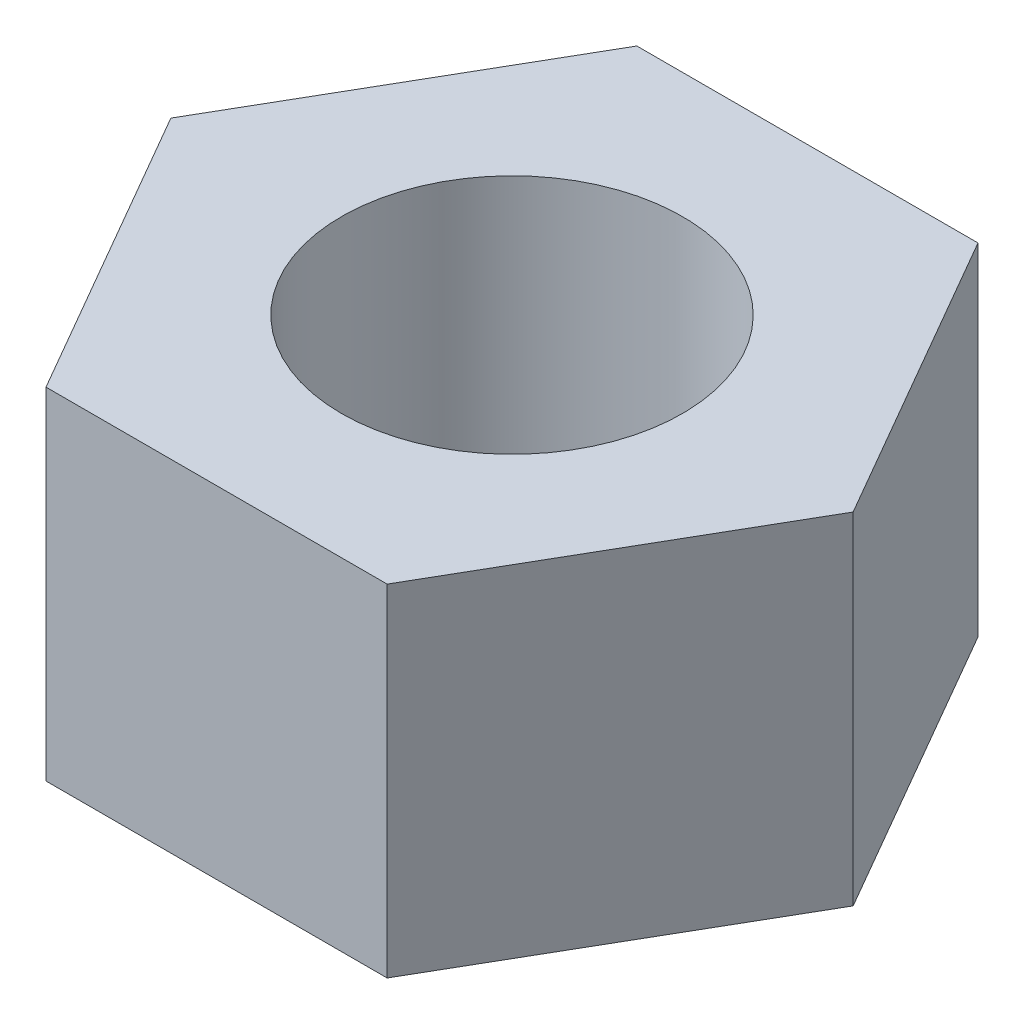
ISO-10303-21;
HEADER;
FILE_DESCRIPTION(('STEP AP214'),'2;1');
FILE_NAME('part.step','',(''),(''),'','','');
FILE_SCHEMA(('AUTOMOTIVE_DESIGN { 1 0 10303 214 1 1 1 1 }'));
ENDSEC;
DATA;
#1=APPLICATION_CONTEXT('core data for automotive mechanical design processes');
#2=APPLICATION_PROTOCOL_DEFINITION('international standard','automotive_design',2000,#1);
#3=PRODUCT_CONTEXT('',#1,'mechanical');
#4=PRODUCT('Part','Part','',(#3));
#5=PRODUCT_RELATED_PRODUCT_CATEGORY('part','',(#4));
#6=PRODUCT_DEFINITION_FORMATION('','',#4);
#7=PRODUCT_DEFINITION_CONTEXT('part definition',#1,'design');
#8=PRODUCT_DEFINITION('design','',#6,#7);
#9=PRODUCT_DEFINITION_SHAPE('','',#8);
#10=(LENGTH_UNIT() NAMED_UNIT(*) SI_UNIT(.MILLI.,.METRE.));
#11=(NAMED_UNIT(*) PLANE_ANGLE_UNIT() SI_UNIT($,.RADIAN.));
#12=(NAMED_UNIT(*) SI_UNIT($,.STERADIAN.) SOLID_ANGLE_UNIT());
#13=UNCERTAINTY_MEASURE_WITH_UNIT(LENGTH_MEASURE(1.E-05),#10,'distance_accuracy_value','');
#14=(GEOMETRIC_REPRESENTATION_CONTEXT(3) GLOBAL_UNCERTAINTY_ASSIGNED_CONTEXT((#13)) GLOBAL_UNIT_ASSIGNED_CONTEXT((#10,
#11,#12)) REPRESENTATION_CONTEXT('',''));
#15=CARTESIAN_POINT('',(0.,0.,0.));
#16=DIRECTION('',(0.,0.,1.));
#17=DIRECTION('',(1.,0.,0.));
#18=AXIS2_PLACEMENT_3D('',#15,#16,#17);
#19=CARTESIAN_POINT('',(0.,4.5,0.));
#20=DIRECTION('',(0.,1.,0.));
#21=DIRECTION('',(0.,0.,1.));
#22=AXIS2_PLACEMENT_3D('',#19,#20,#21);
#23=PLANE('',#22);
#24=DIRECTION('',(1.,0.,0.));
#25=VECTOR('',#24,1.);
#26=CARTESIAN_POINT('',(-4.5,4.5,7.79422863405995));
#27=LINE('',#26,#25);
#28=CARTESIAN_POINT('',(-4.5,4.5,7.79422863405995));
#29=VERTEX_POINT('',#28);
#30=CARTESIAN_POINT('',(4.5,4.5,7.79422863405995));
#31=VERTEX_POINT('',#30);
#32=EDGE_CURVE('E129',#29,#31,#27,.T.);
#33=ORIENTED_EDGE('',*,*,#32,.T.);
#34=DIRECTION('',(0.5,0.,-0.866025403784438));
#35=VECTOR('',#34,1.);
#36=CARTESIAN_POINT('',(4.5,4.5,7.79422863405995));
#37=LINE('',#36,#35);
#38=CARTESIAN_POINT('',(9.,4.5,0.));
#39=VERTEX_POINT('',#38);
#40=EDGE_CURVE('E87',#31,#39,#37,.T.);
#41=ORIENTED_EDGE('',*,*,#40,.T.);
#42=DIRECTION('',(-0.5,0.,-0.866025403784439));
#43=VECTOR('',#42,1.);
#44=CARTESIAN_POINT('',(9.,4.5,0.));
#45=LINE('',#44,#43);
#46=CARTESIAN_POINT('',(4.5,4.5,-7.79422863405995));
#47=VERTEX_POINT('',#46);
#48=EDGE_CURVE('E100',#39,#47,#45,.T.);
#49=ORIENTED_EDGE('',*,*,#48,.T.);
#50=DIRECTION('',(-1.,0.,0.));
#51=VECTOR('',#50,1.);
#52=CARTESIAN_POINT('',(4.5,4.5,-7.79422863405995));
#53=LINE('',#52,#51);
#54=CARTESIAN_POINT('',(-4.5,4.5,-7.79422863405995));
#55=VERTEX_POINT('',#54);
#56=EDGE_CURVE('E94',#47,#55,#53,.T.);
#57=ORIENTED_EDGE('',*,*,#56,.T.);
#58=DIRECTION('',(-0.5,0.,0.866025403784439));
#59=VECTOR('',#58,1.);
#60=CARTESIAN_POINT('',(-4.5,4.5,-7.79422863405995));
#61=LINE('',#60,#59);
#62=CARTESIAN_POINT('',(-9.,4.5,0.));
#63=VERTEX_POINT('',#62);
#64=EDGE_CURVE('E98',#55,#63,#61,.T.);
#65=ORIENTED_EDGE('',*,*,#64,.T.);
#66=DIRECTION('',(0.5,0.,0.866025403784439));
#67=VECTOR('',#66,1.);
#68=CARTESIAN_POINT('',(-9.,4.5,0.));
#69=LINE('',#68,#67);
#70=EDGE_CURVE('E50',#63,#29,#69,.T.);
#71=ORIENTED_EDGE('',*,*,#70,.T.);
#72=EDGE_LOOP('',(#33,#41,#49,#57,#65,#71));
#73=FACE_BOUND('',#72,.T.);
#74=CARTESIAN_POINT('',(0.,4.5,0.));
#75=DIRECTION('',(0.,1.,0.));
#76=DIRECTION('',(0.,0.,1.));
#77=AXIS2_PLACEMENT_3D('',#74,#75,#76);
#78=CIRCLE('',#77,4.5);
#79=CARTESIAN_POINT('',(0.,4.5,4.5));
#80=VERTEX_POINT('',#79);
#81=EDGE_CURVE('E122',#80,#80,#78,.T.);
#82=ORIENTED_EDGE('',*,*,#81,.F.);
#83=EDGE_LOOP('',(#82));
#84=FACE_BOUND('',#83,.T.);
#85=ADVANCED_FACE('F33',(#73,#84),#23,.T.);
#86=CARTESIAN_POINT('',(0.,-4.5,0.));
#87=DIRECTION('',(0.,1.,0.));
#88=DIRECTION('',(0.,0.,1.));
#89=AXIS2_PLACEMENT_3D('',#86,#87,#88);
#90=PLANE('',#89);
#91=DIRECTION('',(1.,0.,0.));
#92=VECTOR('',#91,1.);
#93=CARTESIAN_POINT('',(-4.5,-4.5,7.79422863405995));
#94=LINE('',#93,#92);
#95=CARTESIAN_POINT('',(-4.5,-4.5,7.79422863405995));
#96=VERTEX_POINT('',#95);
#97=CARTESIAN_POINT('',(4.5,-4.5,7.79422863405995));
#98=VERTEX_POINT('',#97);
#99=EDGE_CURVE('E118',#96,#98,#94,.T.);
#100=ORIENTED_EDGE('',*,*,#99,.F.);
#101=DIRECTION('',(0.5,0.,0.866025403784439));
#102=VECTOR('',#101,1.);
#103=CARTESIAN_POINT('',(-9.,-4.5,0.));
#104=LINE('',#103,#102);
#105=CARTESIAN_POINT('',(-9.,-4.5,0.));
#106=VERTEX_POINT('',#105);
#107=EDGE_CURVE('E79',#106,#96,#104,.T.);
#108=ORIENTED_EDGE('',*,*,#107,.F.);
#109=DIRECTION('',(-0.5,0.,0.866025403784439));
#110=VECTOR('',#109,1.);
#111=CARTESIAN_POINT('',(-4.5,-4.5,-7.79422863405995));
#112=LINE('',#111,#110);
#113=CARTESIAN_POINT('',(-4.5,-4.5,-7.79422863405995));
#114=VERTEX_POINT('',#113);
#115=EDGE_CURVE('E73',#114,#106,#112,.T.);
#116=ORIENTED_EDGE('',*,*,#115,.F.);
#117=DIRECTION('',(-1.,0.,0.));
#118=VECTOR('',#117,1.);
#119=CARTESIAN_POINT('',(4.5,-4.5,-7.79422863405995));
#120=LINE('',#119,#118);
#121=CARTESIAN_POINT('',(4.5,-4.5,-7.79422863405995));
#122=VERTEX_POINT('',#121);
#123=EDGE_CURVE('E108',#122,#114,#120,.T.);
#124=ORIENTED_EDGE('',*,*,#123,.F.);
#125=DIRECTION('',(-0.5,0.,-0.866025403784439));
#126=VECTOR('',#125,1.);
#127=CARTESIAN_POINT('',(9.,-4.5,0.));
#128=LINE('',#127,#126);
#129=CARTESIAN_POINT('',(9.,-4.5,0.));
#130=VERTEX_POINT('',#129);
#131=EDGE_CURVE('E124',#130,#122,#128,.T.);
#132=ORIENTED_EDGE('',*,*,#131,.F.);
#133=DIRECTION('',(0.5,0.,-0.866025403784438));
#134=VECTOR('',#133,1.);
#135=CARTESIAN_POINT('',(4.5,-4.5,7.79422863405995));
#136=LINE('',#135,#134);
#137=EDGE_CURVE('E121',#98,#130,#136,.T.);
#138=ORIENTED_EDGE('',*,*,#137,.F.);
#139=EDGE_LOOP('',(#100,#108,#116,#124,#132,#138));
#140=FACE_BOUND('',#139,.T.);
#141=CARTESIAN_POINT('',(0.,-4.5,0.));
#142=DIRECTION('',(0.,1.,0.));
#143=DIRECTION('',(0.,0.,1.));
#144=AXIS2_PLACEMENT_3D('',#141,#142,#143);
#145=CIRCLE('',#144,4.5);
#146=CARTESIAN_POINT('',(0.,-4.5,4.5));
#147=VERTEX_POINT('',#146);
#148=EDGE_CURVE('E222',#147,#147,#145,.T.);
#149=ORIENTED_EDGE('',*,*,#148,.T.);
#150=EDGE_LOOP('',(#149));
#151=FACE_BOUND('',#150,.T.);
#152=ADVANCED_FACE('F138',(#140,#151),#90,.F.);
#153=CARTESIAN_POINT('',(-4.5,4.5,7.79422863405995));
#154=DIRECTION('',(0.,0.,-1.));
#155=DIRECTION('',(-1.,0.,0.));
#156=AXIS2_PLACEMENT_3D('',#153,#154,#155);
#157=PLANE('',#156);
#158=ORIENTED_EDGE('',*,*,#99,.T.);
#159=DIRECTION('',(0.,-1.,0.));
#160=VECTOR('',#159,1.);
#161=CARTESIAN_POINT('',(4.5,4.5,7.79422863405995));
#162=LINE('',#161,#160);
#163=EDGE_CURVE('E11',#31,#98,#162,.T.);
#164=ORIENTED_EDGE('',*,*,#163,.F.);
#165=ORIENTED_EDGE('',*,*,#32,.F.);
#166=DIRECTION('',(0.,-1.,0.));
#167=VECTOR('',#166,1.);
#168=CARTESIAN_POINT('',(-4.5,4.5,7.79422863405995));
#169=LINE('',#168,#167);
#170=EDGE_CURVE('E114',#29,#96,#169,.T.);
#171=ORIENTED_EDGE('',*,*,#170,.T.);
#172=EDGE_LOOP('',(#158,#164,#165,#171));
#173=FACE_BOUND('',#172,.T.);
#174=ADVANCED_FACE('F35',(#173),#157,.F.);
#175=CARTESIAN_POINT('',(4.5,4.5,7.79422863405995));
#176=DIRECTION('',(-0.866025403784439,0.,-0.5));
#177=DIRECTION('',(-0.5,0.,0.866025403784439));
#178=AXIS2_PLACEMENT_3D('',#175,#176,#177);
#179=PLANE('',#178);
#180=ORIENTED_EDGE('',*,*,#137,.T.);
#181=DIRECTION('',(0.,-1.,0.));
#182=VECTOR('',#181,1.);
#183=CARTESIAN_POINT('',(9.,4.5,0.));
#184=LINE('',#183,#182);
#185=EDGE_CURVE('E42',#39,#130,#184,.T.);
#186=ORIENTED_EDGE('',*,*,#185,.F.);
#187=ORIENTED_EDGE('',*,*,#40,.F.);
#188=ORIENTED_EDGE('',*,*,#163,.T.);
#189=EDGE_LOOP('',(#180,#186,#187,#188));
#190=FACE_BOUND('',#189,.T.);
#191=ADVANCED_FACE('F163',(#190),#179,.F.);
#192=CARTESIAN_POINT('',(9.,4.5,0.));
#193=DIRECTION('',(-0.866025403784439,0.,0.5));
#194=DIRECTION('',(0.5,0.,0.866025403784439));
#195=AXIS2_PLACEMENT_3D('',#192,#193,#194);
#196=PLANE('',#195);
#197=ORIENTED_EDGE('',*,*,#131,.T.);
#198=DIRECTION('',(0.,-1.,0.));
#199=VECTOR('',#198,1.);
#200=CARTESIAN_POINT('',(4.5,4.5,-7.79422863405995));
#201=LINE('',#200,#199);
#202=EDGE_CURVE('E109',#47,#122,#201,.T.);
#203=ORIENTED_EDGE('',*,*,#202,.F.);
#204=ORIENTED_EDGE('',*,*,#48,.F.);
#205=ORIENTED_EDGE('',*,*,#185,.T.);
#206=EDGE_LOOP('',(#197,#203,#204,#205));
#207=FACE_BOUND('',#206,.T.);
#208=ADVANCED_FACE('F135',(#207),#196,.F.);
#209=CARTESIAN_POINT('',(4.5,4.5,-7.79422863405995));
#210=DIRECTION('',(0.,0.,1.));
#211=DIRECTION('',(1.,0.,0.));
#212=AXIS2_PLACEMENT_3D('',#209,#210,#211);
#213=PLANE('',#212);
#214=ORIENTED_EDGE('',*,*,#123,.T.);
#215=DIRECTION('',(0.,-1.,0.));
#216=VECTOR('',#215,1.);
#217=CARTESIAN_POINT('',(-4.5,4.5,-7.79422863405995));
#218=LINE('',#217,#216);
#219=EDGE_CURVE('E105',#55,#114,#218,.T.);
#220=ORIENTED_EDGE('',*,*,#219,.F.);
#221=ORIENTED_EDGE('',*,*,#56,.F.);
#222=ORIENTED_EDGE('',*,*,#202,.T.);
#223=EDGE_LOOP('',(#214,#220,#221,#222));
#224=FACE_BOUND('',#223,.T.);
#225=ADVANCED_FACE('F106',(#224),#213,.F.);
#226=CARTESIAN_POINT('',(-4.5,4.5,-7.79422863405995));
#227=DIRECTION('',(0.866025403784438,0.,0.5));
#228=DIRECTION('',(0.5,0.,-0.866025403784439));
#229=AXIS2_PLACEMENT_3D('',#226,#227,#228);
#230=PLANE('',#229);
#231=ORIENTED_EDGE('',*,*,#115,.T.);
#232=DIRECTION('',(0.,-1.,0.));
#233=VECTOR('',#232,1.);
#234=CARTESIAN_POINT('',(-9.,4.5,0.));
#235=LINE('',#234,#233);
#236=EDGE_CURVE('E110',#63,#106,#235,.T.);
#237=ORIENTED_EDGE('',*,*,#236,.F.);
#238=ORIENTED_EDGE('',*,*,#64,.F.);
#239=ORIENTED_EDGE('',*,*,#219,.T.);
#240=EDGE_LOOP('',(#231,#237,#238,#239));
#241=FACE_BOUND('',#240,.T.);
#242=ADVANCED_FACE('F112',(#241),#230,.F.);
#243=CARTESIAN_POINT('',(-9.,4.5,0.));
#244=DIRECTION('',(0.866025403784439,0.,-0.5));
#245=DIRECTION('',(-0.5,0.,-0.866025403784439));
#246=AXIS2_PLACEMENT_3D('',#243,#244,#245);
#247=PLANE('',#246);
#248=ORIENTED_EDGE('',*,*,#107,.T.);
#249=ORIENTED_EDGE('',*,*,#170,.F.);
#250=ORIENTED_EDGE('',*,*,#70,.F.);
#251=ORIENTED_EDGE('',*,*,#236,.T.);
#252=EDGE_LOOP('',(#248,#249,#250,#251));
#253=FACE_BOUND('',#252,.T.);
#254=ADVANCED_FACE('F143',(#253),#247,.F.);
#255=CARTESIAN_POINT('',(0.,4.5,0.));
#256=DIRECTION('',(0.,-1.,0.));
#257=DIRECTION('',(0.,0.,-1.));
#258=AXIS2_PLACEMENT_3D('',#255,#256,#257);
#259=CYLINDRICAL_SURFACE('',#258,4.5);
#260=ORIENTED_EDGE('',*,*,#81,.T.);
#261=EDGE_LOOP('',(#260));
#262=FACE_BOUND('',#261,.T.);
#263=ORIENTED_EDGE('',*,*,#148,.F.);
#264=EDGE_LOOP('',(#263));
#265=FACE_BOUND('',#264,.T.);
#266=ADVANCED_FACE('F145',(#262,#265),#259,.F.);
#267=CLOSED_SHELL('',(#85,#152,#174,#191,#208,#225,#242,#254,#266));
#268=MANIFOLD_SOLID_BREP('B2',#267);
#269=ADVANCED_BREP_SHAPE_REPRESENTATION('',(#18,#268),#14);
#270=SHAPE_DEFINITION_REPRESENTATION(#9,#269);
ENDSEC;
END-ISO-10303-21;
